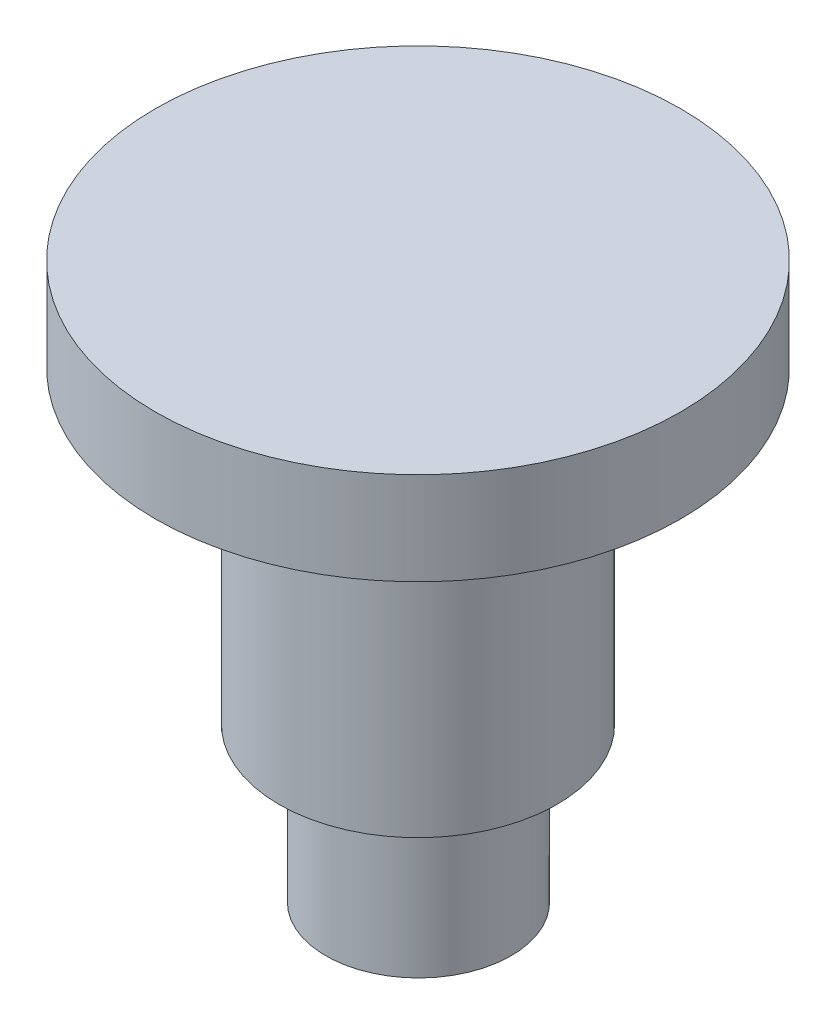
ISO-10303-21;
HEADER;
FILE_DESCRIPTION(('STEP AP214'),'2;1');
FILE_NAME('part.step','',(''),(''),'','','');
FILE_SCHEMA(('AUTOMOTIVE_DESIGN { 1 0 10303 214 1 1 1 1 }'));
ENDSEC;
DATA;
#1=APPLICATION_CONTEXT('core data for automotive mechanical design processes');
#2=APPLICATION_PROTOCOL_DEFINITION('international standard','automotive_design',2000,#1);
#3=PRODUCT_CONTEXT('',#1,'mechanical');
#4=PRODUCT('Part','Part','',(#3));
#5=PRODUCT_RELATED_PRODUCT_CATEGORY('part','',(#4));
#6=PRODUCT_DEFINITION_FORMATION('','',#4);
#7=PRODUCT_DEFINITION_CONTEXT('part definition',#1,'design');
#8=PRODUCT_DEFINITION('design','',#6,#7);
#9=PRODUCT_DEFINITION_SHAPE('','',#8);
#10=(LENGTH_UNIT() NAMED_UNIT(*) SI_UNIT(.MILLI.,.METRE.));
#11=(NAMED_UNIT(*) PLANE_ANGLE_UNIT() SI_UNIT($,.RADIAN.));
#12=(NAMED_UNIT(*) SI_UNIT($,.STERADIAN.) SOLID_ANGLE_UNIT());
#13=UNCERTAINTY_MEASURE_WITH_UNIT(LENGTH_MEASURE(1.E-05),#10,'distance_accuracy_value','');
#14=(GEOMETRIC_REPRESENTATION_CONTEXT(3) GLOBAL_UNCERTAINTY_ASSIGNED_CONTEXT((#13)) GLOBAL_UNIT_ASSIGNED_CONTEXT((#10,
#11,#12)) REPRESENTATION_CONTEXT('',''));
#15=CARTESIAN_POINT('',(0.,0.,0.));
#16=DIRECTION('',(0.,0.,1.));
#17=DIRECTION('',(1.,0.,0.));
#18=AXIS2_PLACEMENT_3D('',#15,#16,#17);
#19=CARTESIAN_POINT('',(0.,1.5,0.));
#20=DIRECTION('',(0.,-1.,0.));
#21=DIRECTION('',(0.,0.,-1.));
#22=AXIS2_PLACEMENT_3D('',#19,#20,#21);
#23=CYLINDRICAL_SURFACE('',#22,4.25);
#24=CARTESIAN_POINT('',(0.,1.5,0.));
#25=DIRECTION('',(0.,1.,0.));
#26=DIRECTION('',(0.,0.,1.));
#27=AXIS2_PLACEMENT_3D('',#24,#25,#26);
#28=CIRCLE('',#27,4.25);
#29=CARTESIAN_POINT('',(0.,1.5,4.25));
#30=VERTEX_POINT('',#29);
#31=EDGE_CURVE('E45',#30,#30,#28,.T.);
#32=ORIENTED_EDGE('',*,*,#31,.F.);
#33=EDGE_LOOP('',(#32));
#34=FACE_BOUND('',#33,.T.);
#35=CARTESIAN_POINT('',(0.,0.,0.));
#36=DIRECTION('',(0.,1.,0.));
#37=DIRECTION('',(0.,0.,1.));
#38=AXIS2_PLACEMENT_3D('',#35,#36,#37);
#39=CIRCLE('',#38,4.25);
#40=CARTESIAN_POINT('',(0.,0.,4.25));
#41=VERTEX_POINT('',#40);
#42=EDGE_CURVE('E40',#41,#41,#39,.T.);
#43=ORIENTED_EDGE('',*,*,#42,.T.);
#44=EDGE_LOOP('',(#43));
#45=FACE_BOUND('',#44,.T.);
#46=ADVANCED_FACE('F37',(#34,#45),#23,.T.);
#47=CARTESIAN_POINT('',(0.,1.5,0.));
#48=DIRECTION('',(0.,1.,0.));
#49=DIRECTION('',(0.,0.,1.));
#50=AXIS2_PLACEMENT_3D('',#47,#48,#49);
#51=PLANE('',#50);
#52=ORIENTED_EDGE('',*,*,#31,.T.);
#53=EDGE_LOOP('',(#52));
#54=FACE_BOUND('',#53,.T.);
#55=ADVANCED_FACE('F82',(#54),#51,.T.);
#56=CARTESIAN_POINT('',(0.,0.,0.));
#57=DIRECTION('',(0.,1.,0.));
#58=DIRECTION('',(0.,0.,1.));
#59=AXIS2_PLACEMENT_3D('',#56,#57,#58);
#60=PLANE('',#59);
#61=CARTESIAN_POINT('',(0.,0.,0.));
#62=DIRECTION('',(0.,1.,0.));
#63=DIRECTION('',(0.,0.,1.));
#64=AXIS2_PLACEMENT_3D('',#61,#62,#63);
#65=CIRCLE('',#64,2.25);
#66=CARTESIAN_POINT('',(0.,0.,2.25));
#67=VERTEX_POINT('',#66);
#68=EDGE_CURVE('E58',#67,#67,#65,.T.);
#69=ORIENTED_EDGE('',*,*,#68,.T.);
#70=EDGE_LOOP('',(#69));
#71=FACE_BOUND('',#70,.T.);
#72=ORIENTED_EDGE('',*,*,#42,.F.);
#73=EDGE_LOOP('',(#72));
#74=FACE_BOUND('',#73,.T.);
#75=ADVANCED_FACE('F87',(#71,#74),#60,.F.);
#76=CARTESIAN_POINT('',(0.,-5.,0.));
#77=DIRECTION('',(0.,1.,0.));
#78=DIRECTION('',(0.,0.,1.));
#79=AXIS2_PLACEMENT_3D('',#76,#77,#78);
#80=CYLINDRICAL_SURFACE('',#79,2.25);
#81=CARTESIAN_POINT('',(0.,-5.,0.));
#82=DIRECTION('',(0.,1.,0.));
#83=DIRECTION('',(0.,0.,1.));
#84=AXIS2_PLACEMENT_3D('',#81,#82,#83);
#85=CIRCLE('',#84,2.25);
#86=CARTESIAN_POINT('',(0.,-5.,2.25));
#87=VERTEX_POINT('',#86);
#88=EDGE_CURVE('E54',#87,#87,#85,.T.);
#89=ORIENTED_EDGE('',*,*,#88,.T.);
#90=EDGE_LOOP('',(#89));
#91=FACE_BOUND('',#90,.T.);
#92=ORIENTED_EDGE('',*,*,#68,.F.);
#93=EDGE_LOOP('',(#92));
#94=FACE_BOUND('',#93,.T.);
#95=ADVANCED_FACE('F78',(#91,#94),#80,.T.);
#96=CARTESIAN_POINT('',(0.,-5.,0.));
#97=DIRECTION('',(0.,1.,0.));
#98=DIRECTION('',(0.,0.,1.));
#99=AXIS2_PLACEMENT_3D('',#96,#97,#98);
#100=PLANE('',#99);
#101=CARTESIAN_POINT('',(0.,-5.,-0.007534146320622));
#102=DIRECTION('',(0.,-1.,0.));
#103=DIRECTION('',(0.,0.,-1.));
#104=AXIS2_PLACEMENT_3D('',#101,#102,#103);
#105=CIRCLE('',#104,1.5);
#106=CARTESIAN_POINT('',(0.,-5.,-1.50753414632062));
#107=VERTEX_POINT('',#106);
#108=EDGE_CURVE('E10',#107,#107,#105,.T.);
#109=ORIENTED_EDGE('',*,*,#108,.F.);
#110=EDGE_LOOP('',(#109));
#111=FACE_BOUND('',#110,.T.);
#112=ORIENTED_EDGE('',*,*,#88,.F.);
#113=EDGE_LOOP('',(#112));
#114=FACE_BOUND('',#113,.T.);
#115=ADVANCED_FACE('F71',(#111,#114),#100,.F.);
#116=CARTESIAN_POINT('',(0.,-7.5,-0.007534146320622));
#117=DIRECTION('',(0.,1.,0.));
#118=DIRECTION('',(0.,0.,1.));
#119=AXIS2_PLACEMENT_3D('',#116,#117,#118);
#120=CYLINDRICAL_SURFACE('',#119,1.5);
#121=CARTESIAN_POINT('',(0.,-7.5,-0.007534146320622));
#122=DIRECTION('',(0.,-1.,0.));
#123=DIRECTION('',(0.,0.,-1.));
#124=AXIS2_PLACEMENT_3D('',#121,#122,#123);
#125=CIRCLE('',#124,1.5);
#126=CARTESIAN_POINT('',(0.,-7.5,-1.50753414632062));
#127=VERTEX_POINT('',#126);
#128=EDGE_CURVE('E53',#127,#127,#125,.T.);
#129=ORIENTED_EDGE('',*,*,#128,.F.);
#130=EDGE_LOOP('',(#129));
#131=FACE_BOUND('',#130,.T.);
#132=ORIENTED_EDGE('',*,*,#108,.T.);
#133=EDGE_LOOP('',(#132));
#134=FACE_BOUND('',#133,.T.);
#135=ADVANCED_FACE('F69',(#131,#134),#120,.T.);
#136=CARTESIAN_POINT('',(0.,-7.5,-0.007534146320622));
#137=DIRECTION('',(0.,-1.,0.));
#138=DIRECTION('',(0.,0.,-1.));
#139=AXIS2_PLACEMENT_3D('',#136,#137,#138);
#140=PLANE('',#139);
#141=ORIENTED_EDGE('',*,*,#128,.T.);
#142=EDGE_LOOP('',(#141));
#143=FACE_BOUND('',#142,.T.);
#144=ADVANCED_FACE('F67',(#143),#140,.T.);
#145=CLOSED_SHELL('',(#46,#55,#75,#95,#115,#135,#144));
#146=MANIFOLD_SOLID_BREP('B2',#145);
#147=ADVANCED_BREP_SHAPE_REPRESENTATION('',(#18,#146),#14);
#148=SHAPE_DEFINITION_REPRESENTATION(#9,#147);
ENDSEC;
END-ISO-10303-21;
